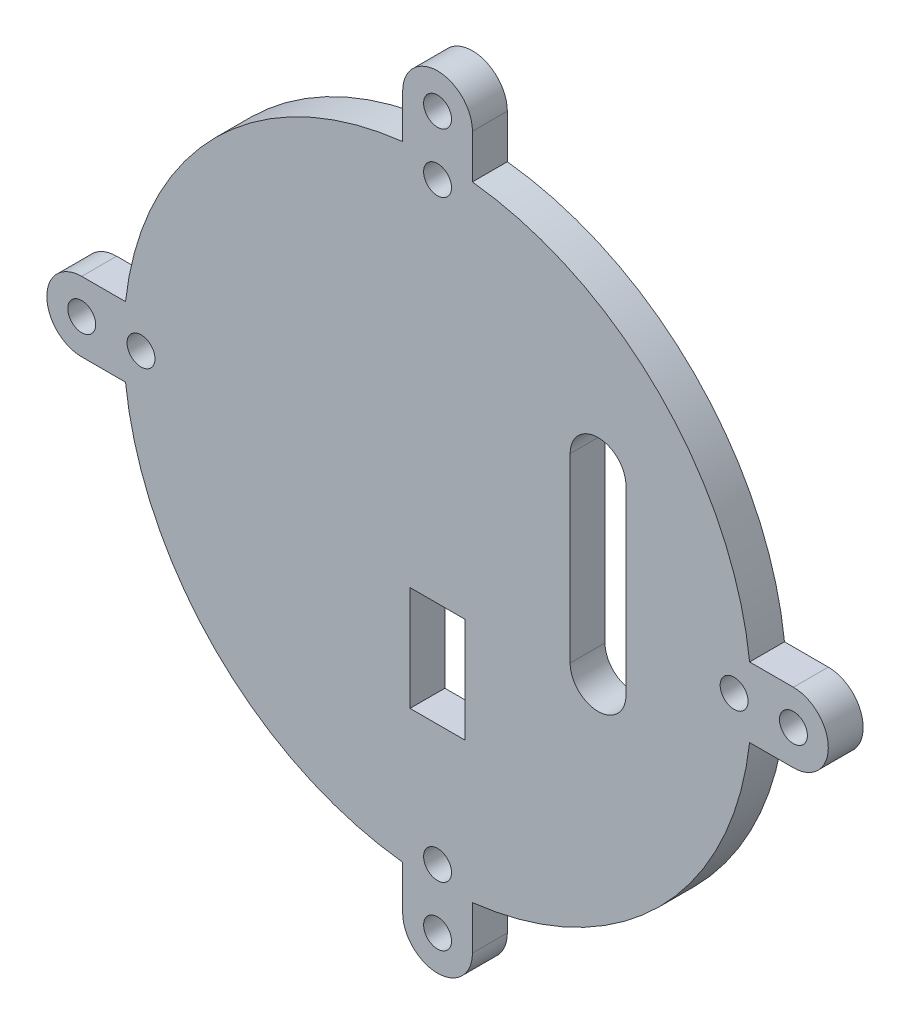
ISO-10303-21;
HEADER;
FILE_DESCRIPTION(('STEP AP214'),'2;1');
FILE_NAME('part.step','',(''),(''),'','','');
FILE_SCHEMA(('AUTOMOTIVE_DESIGN { 1 0 10303 214 1 1 1 1 }'));
ENDSEC;
DATA;
#1=APPLICATION_CONTEXT('core data for automotive mechanical design processes');
#2=APPLICATION_PROTOCOL_DEFINITION('international standard','automotive_design',2000,#1);
#3=PRODUCT_CONTEXT('',#1,'mechanical');
#4=PRODUCT('Part','Part','',(#3));
#5=PRODUCT_RELATED_PRODUCT_CATEGORY('part','',(#4));
#6=PRODUCT_DEFINITION_FORMATION('','',#4);
#7=PRODUCT_DEFINITION_CONTEXT('part definition',#1,'design');
#8=PRODUCT_DEFINITION('design','',#6,#7);
#9=PRODUCT_DEFINITION_SHAPE('','',#8);
#10=(LENGTH_UNIT() NAMED_UNIT(*) SI_UNIT(.MILLI.,.METRE.));
#11=(NAMED_UNIT(*) PLANE_ANGLE_UNIT() SI_UNIT($,.RADIAN.));
#12=(NAMED_UNIT(*) SI_UNIT($,.STERADIAN.) SOLID_ANGLE_UNIT());
#13=UNCERTAINTY_MEASURE_WITH_UNIT(LENGTH_MEASURE(1.E-05),#10,'distance_accuracy_value','');
#14=(GEOMETRIC_REPRESENTATION_CONTEXT(3) GLOBAL_UNCERTAINTY_ASSIGNED_CONTEXT((#13)) GLOBAL_UNIT_ASSIGNED_CONTEXT((#10,
#11,#12)) REPRESENTATION_CONTEXT('',''));
#15=CARTESIAN_POINT('',(0.,0.,0.));
#16=DIRECTION('',(0.,0.,1.));
#17=DIRECTION('',(1.,0.,0.));
#18=AXIS2_PLACEMENT_3D('',#15,#16,#17);
#19=CARTESIAN_POINT('',(0.,5.00000000000128,5.));
#20=DIRECTION('',(0.,-1.,0.));
#21=DIRECTION('',(0.,0.,-1.));
#22=AXIS2_PLACEMENT_3D('',#19,#20,#21);
#23=PLANE('',#22);
#24=DIRECTION('',(-1.,0.,0.));
#25=VECTOR('',#24,1.);
#26=CARTESIAN_POINT('',(0.,5.00000000000128,0.));
#27=LINE('',#26,#25);
#28=CARTESIAN_POINT('',(50.9999999999998,5.00000000000128,0.));
#29=VERTEX_POINT('',#28);
#30=CARTESIAN_POINT('',(44.7213595499955,5.00000000000127,0.));
#31=VERTEX_POINT('',#30);
#32=EDGE_CURVE('E260',#29,#31,#27,.T.);
#33=ORIENTED_EDGE('',*,*,#32,.T.);
#34=DIRECTION('',(0.,0.,-1.));
#35=VECTOR('',#34,1.);
#36=CARTESIAN_POINT('',(44.7213595499955,5.00000000000127,5.));
#37=LINE('',#36,#35);
#38=CARTESIAN_POINT('',(44.7213595499955,5.00000000000127,5.));
#39=VERTEX_POINT('',#38);
#40=EDGE_CURVE('E11',#39,#31,#37,.T.);
#41=ORIENTED_EDGE('',*,*,#40,.F.);
#42=DIRECTION('',(-1.,0.,0.));
#43=VECTOR('',#42,1.);
#44=CARTESIAN_POINT('',(0.,5.00000000000128,5.));
#45=LINE('',#44,#43);
#46=CARTESIAN_POINT('',(50.9999999999998,5.00000000000128,5.));
#47=VERTEX_POINT('',#46);
#48=EDGE_CURVE('E261',#47,#39,#45,.T.);
#49=ORIENTED_EDGE('',*,*,#48,.F.);
#50=DIRECTION('',(0.,0.,-1.));
#51=VECTOR('',#50,1.);
#52=CARTESIAN_POINT('',(50.9999999999998,5.00000000000128,5.));
#53=LINE('',#52,#51);
#54=EDGE_CURVE('E320',#47,#29,#53,.T.);
#55=ORIENTED_EDGE('',*,*,#54,.T.);
#56=EDGE_LOOP('',(#33,#41,#49,#55));
#57=FACE_BOUND('',#56,.T.);
#58=ADVANCED_FACE('F36',(#57),#23,.F.);
#59=CARTESIAN_POINT('',(3.46944695195361E-13,0.,5.));
#60=DIRECTION('',(0.,0.,-1.));
#61=DIRECTION('',(-1.,0.,0.));
#62=AXIS2_PLACEMENT_3D('',#59,#60,#61);
#63=CYLINDRICAL_SURFACE('',#62,44.9999999999994);
#64=CARTESIAN_POINT('',(3.46944695195361E-13,0.,0.));
#65=DIRECTION('',(0.,0.,1.));
#66=DIRECTION('',(1.,0.,0.));
#67=AXIS2_PLACEMENT_3D('',#64,#65,#66);
#68=CIRCLE('',#67,44.9999999999994);
#69=CARTESIAN_POINT('',(5.00000000000035,44.7213595499955,0.));
#70=VERTEX_POINT('',#69);
#71=EDGE_CURVE('E323',#31,#70,#68,.T.);
#72=ORIENTED_EDGE('',*,*,#71,.T.);
#73=DIRECTION('',(0.,0.,-1.));
#74=VECTOR('',#73,1.);
#75=CARTESIAN_POINT('',(5.00000000000035,44.7213595499955,5.));
#76=LINE('',#75,#74);
#77=CARTESIAN_POINT('',(5.00000000000035,44.7213595499955,5.));
#78=VERTEX_POINT('',#77);
#79=EDGE_CURVE('E43',#78,#70,#76,.T.);
#80=ORIENTED_EDGE('',*,*,#79,.F.);
#81=CARTESIAN_POINT('',(3.46944695195361E-13,0.,5.));
#82=DIRECTION('',(0.,0.,1.));
#83=DIRECTION('',(1.,0.,0.));
#84=AXIS2_PLACEMENT_3D('',#81,#82,#83);
#85=CIRCLE('',#84,44.9999999999994);
#86=EDGE_CURVE('E264',#39,#78,#85,.T.);
#87=ORIENTED_EDGE('',*,*,#86,.F.);
#88=ORIENTED_EDGE('',*,*,#40,.T.);
#89=EDGE_LOOP('',(#72,#80,#87,#88));
#90=FACE_BOUND('',#89,.T.);
#91=ADVANCED_FACE('F417',(#90),#63,.T.);
#92=CARTESIAN_POINT('',(4.99999999999975,0.,5.));
#93=DIRECTION('',(1.,0.,0.));
#94=DIRECTION('',(0.,1.,0.));
#95=AXIS2_PLACEMENT_3D('',#92,#93,#94);
#96=PLANE('',#95);
#97=DIRECTION('',(0.,-1.,0.));
#98=VECTOR('',#97,1.);
#99=CARTESIAN_POINT('',(4.99999999999975,0.,0.));
#100=LINE('',#99,#98);
#101=CARTESIAN_POINT('',(5.00000000000046,50.9999999999999,0.));
#102=VERTEX_POINT('',#101);
#103=EDGE_CURVE('E326',#102,#70,#100,.T.);
#104=ORIENTED_EDGE('',*,*,#103,.F.);
#105=DIRECTION('',(0.,0.,-1.));
#106=VECTOR('',#105,1.);
#107=CARTESIAN_POINT('',(5.00000000000046,50.9999999999999,5.));
#108=LINE('',#107,#106);
#109=CARTESIAN_POINT('',(5.00000000000046,50.9999999999999,5.));
#110=VERTEX_POINT('',#109);
#111=EDGE_CURVE('E410',#110,#102,#108,.T.);
#112=ORIENTED_EDGE('',*,*,#111,.F.);
#113=DIRECTION('',(0.,-1.,0.));
#114=VECTOR('',#113,1.);
#115=CARTESIAN_POINT('',(4.99999999999975,0.,5.));
#116=LINE('',#115,#114);
#117=EDGE_CURVE('E267',#110,#78,#116,.T.);
#118=ORIENTED_EDGE('',*,*,#117,.T.);
#119=ORIENTED_EDGE('',*,*,#79,.T.);
#120=EDGE_LOOP('',(#104,#112,#118,#119));
#121=FACE_BOUND('',#120,.T.);
#122=ADVANCED_FACE('F414',(#121),#96,.T.);
#123=CARTESIAN_POINT('',(8.78637440582253E-13,51.,5.));
#124=DIRECTION('',(0.,0.,-1.));
#125=DIRECTION('',(-1.,0.,0.));
#126=AXIS2_PLACEMENT_3D('',#123,#124,#125);
#127=CYLINDRICAL_SURFACE('',#126,5.);
#128=CARTESIAN_POINT('',(8.78637440582253E-13,51.,0.));
#129=DIRECTION('',(0.,0.,1.));
#130=DIRECTION('',(1.,0.,0.));
#131=AXIS2_PLACEMENT_3D('',#128,#129,#130);
#132=CIRCLE('',#131,5.);
#133=CARTESIAN_POINT('',(-4.99999999999954,51.0000000000001,0.));
#134=VERTEX_POINT('',#133);
#135=EDGE_CURVE('E331',#102,#134,#132,.T.);
#136=ORIENTED_EDGE('',*,*,#135,.T.);
#137=DIRECTION('',(0.,0.,-1.));
#138=VECTOR('',#137,1.);
#139=CARTESIAN_POINT('',(-4.99999999999954,51.0000000000001,5.));
#140=LINE('',#139,#138);
#141=CARTESIAN_POINT('',(-4.99999999999954,51.0000000000001,5.));
#142=VERTEX_POINT('',#141);
#143=EDGE_CURVE('E407',#142,#134,#140,.T.);
#144=ORIENTED_EDGE('',*,*,#143,.F.);
#145=CARTESIAN_POINT('',(8.78637440582253E-13,51.,5.));
#146=DIRECTION('',(0.,0.,1.));
#147=DIRECTION('',(1.,0.,0.));
#148=AXIS2_PLACEMENT_3D('',#145,#146,#147);
#149=CIRCLE('',#148,5.);
#150=EDGE_CURVE('E272',#110,#142,#149,.T.);
#151=ORIENTED_EDGE('',*,*,#150,.F.);
#152=ORIENTED_EDGE('',*,*,#111,.T.);
#153=EDGE_LOOP('',(#136,#144,#151,#152));
#154=FACE_BOUND('',#153,.T.);
#155=ADVANCED_FACE('F427',(#154),#127,.T.);
#156=CARTESIAN_POINT('',(-5.00000000000024,0.,5.));
#157=DIRECTION('',(1.,0.,0.));
#158=DIRECTION('',(0.,1.,0.));
#159=AXIS2_PLACEMENT_3D('',#156,#157,#158);
#160=PLANE('',#159);
#161=DIRECTION('',(0.,-1.,0.));
#162=VECTOR('',#161,1.);
#163=CARTESIAN_POINT('',(-5.00000000000024,0.,0.));
#164=LINE('',#163,#162);
#165=CARTESIAN_POINT('',(-4.99999999999959,44.7213595499955,0.));
#166=VERTEX_POINT('',#165);
#167=EDGE_CURVE('E333',#134,#166,#164,.T.);
#168=ORIENTED_EDGE('',*,*,#167,.T.);
#169=DIRECTION('',(0.,0.,-1.));
#170=VECTOR('',#169,1.);
#171=CARTESIAN_POINT('',(-4.99999999999959,44.7213595499955,5.));
#172=LINE('',#171,#170);
#173=CARTESIAN_POINT('',(-4.99999999999959,44.7213595499955,5.));
#174=VERTEX_POINT('',#173);
#175=EDGE_CURVE('E404',#174,#166,#172,.T.);
#176=ORIENTED_EDGE('',*,*,#175,.F.);
#177=DIRECTION('',(0.,-1.,0.));
#178=VECTOR('',#177,1.);
#179=CARTESIAN_POINT('',(-5.00000000000024,0.,5.));
#180=LINE('',#179,#178);
#181=EDGE_CURVE('E274',#142,#174,#180,.T.);
#182=ORIENTED_EDGE('',*,*,#181,.F.);
#183=ORIENTED_EDGE('',*,*,#143,.T.);
#184=EDGE_LOOP('',(#168,#176,#182,#183));
#185=FACE_BOUND('',#184,.T.);
#186=ADVANCED_FACE('F431',(#185),#160,.F.);
#187=CARTESIAN_POINT('',(-44.7213595499953,5.00000000000104,0.));
#188=VERTEX_POINT('',#187);
#189=EDGE_CURVE('E328',#166,#188,#68,.T.);
#190=ORIENTED_EDGE('',*,*,#189,.T.);
#191=DIRECTION('',(0.,0.,-1.));
#192=VECTOR('',#191,1.);
#193=CARTESIAN_POINT('',(-44.7213595499953,5.00000000000104,5.));
#194=LINE('',#193,#192);
#195=CARTESIAN_POINT('',(-44.7213595499953,5.00000000000104,5.));
#196=VERTEX_POINT('',#195);
#197=EDGE_CURVE('E402',#196,#188,#194,.T.);
#198=ORIENTED_EDGE('',*,*,#197,.F.);
#199=EDGE_CURVE('E269',#174,#196,#85,.T.);
#200=ORIENTED_EDGE('',*,*,#199,.F.);
#201=ORIENTED_EDGE('',*,*,#175,.T.);
#202=EDGE_LOOP('',(#190,#198,#200,#201));
#203=FACE_BOUND('',#202,.T.);
#204=ADVANCED_FACE('F463',(#203),#63,.T.);
#205=CARTESIAN_POINT('',(1.22948901590497E-13,5.00000000000001,5.));
#206=DIRECTION('',(0.,1.,0.));
#207=DIRECTION('',(-1.,0.,0.));
#208=AXIS2_PLACEMENT_3D('',#205,#206,#207);
#209=PLANE('',#208);
#210=DIRECTION('',(1.,0.,0.));
#211=VECTOR('',#210,1.);
#212=CARTESIAN_POINT('',(1.22948901590497E-13,5.00000000000001,0.));
#213=LINE('',#212,#211);
#214=CARTESIAN_POINT('',(-51.0000000000001,5.00000000000126,0.));
#215=VERTEX_POINT('',#214);
#216=EDGE_CURVE('E335',#215,#188,#213,.T.);
#217=ORIENTED_EDGE('',*,*,#216,.F.);
#218=DIRECTION('',(0.,0.,-1.));
#219=VECTOR('',#218,1.);
#220=CARTESIAN_POINT('',(-51.0000000000001,5.00000000000126,5.));
#221=LINE('',#220,#219);
#222=CARTESIAN_POINT('',(-51.0000000000001,5.00000000000126,5.));
#223=VERTEX_POINT('',#222);
#224=EDGE_CURVE('E400',#223,#215,#221,.T.);
#225=ORIENTED_EDGE('',*,*,#224,.F.);
#226=DIRECTION('',(1.,0.,0.));
#227=VECTOR('',#226,1.);
#228=CARTESIAN_POINT('',(1.22948901590497E-13,5.00000000000001,5.));
#229=LINE('',#228,#227);
#230=EDGE_CURVE('E276',#223,#196,#229,.T.);
#231=ORIENTED_EDGE('',*,*,#230,.T.);
#232=ORIENTED_EDGE('',*,*,#197,.T.);
#233=EDGE_LOOP('',(#217,#225,#231,#232));
#234=FACE_BOUND('',#233,.T.);
#235=ADVANCED_FACE('F468',(#234),#209,.T.);
#236=CARTESIAN_POINT('',(-51.0000000000003,1.2637460522491E-12,5.));
#237=DIRECTION('',(0.,0.,-1.));
#238=DIRECTION('',(-1.,0.,0.));
#239=AXIS2_PLACEMENT_3D('',#236,#237,#238);
#240=CYLINDRICAL_SURFACE('',#239,5.00000000000105);
#241=CARTESIAN_POINT('',(-51.0000000000003,1.2637460522491E-12,0.));
#242=DIRECTION('',(0.,0.,1.));
#243=DIRECTION('',(1.,0.,0.));
#244=AXIS2_PLACEMENT_3D('',#241,#242,#243);
#245=CIRCLE('',#244,5.00000000000105);
#246=CARTESIAN_POINT('',(-50.9999999999837,-5.00000000000084,0.));
#247=VERTEX_POINT('',#246);
#248=EDGE_CURVE('E338',#215,#247,#245,.T.);
#249=ORIENTED_EDGE('',*,*,#248,.T.);
#250=DIRECTION('',(0.,0.,-1.));
#251=VECTOR('',#250,1.);
#252=CARTESIAN_POINT('',(-50.9999999999837,-5.00000000000084,5.));
#253=LINE('',#252,#251);
#254=CARTESIAN_POINT('',(-50.9999999999837,-5.00000000000084,5.));
#255=VERTEX_POINT('',#254);
#256=EDGE_CURVE('E397',#255,#247,#253,.T.);
#257=ORIENTED_EDGE('',*,*,#256,.F.);
#258=CARTESIAN_POINT('',(-51.0000000000003,1.2637460522491E-12,5.));
#259=DIRECTION('',(0.,0.,1.));
#260=DIRECTION('',(1.,0.,0.));
#261=AXIS2_PLACEMENT_3D('',#258,#259,#260);
#262=CIRCLE('',#261,5.00000000000105);
#263=EDGE_CURVE('E279',#223,#255,#262,.T.);
#264=ORIENTED_EDGE('',*,*,#263,.F.);
#265=ORIENTED_EDGE('',*,*,#224,.T.);
#266=EDGE_LOOP('',(#249,#257,#264,#265));
#267=FACE_BOUND('',#266,.T.);
#268=ADVANCED_FACE('F474',(#267),#240,.T.);
#269=CARTESIAN_POINT('',(-1.23639625757117E-13,-5.0000000000021,5.));
#270=DIRECTION('',(0.,1.,0.));
#271=DIRECTION('',(-1.,0.,0.));
#272=AXIS2_PLACEMENT_3D('',#269,#270,#271);
#273=PLANE('',#272);
#274=DIRECTION('',(1.,0.,0.));
#275=VECTOR('',#274,1.);
#276=CARTESIAN_POINT('',(-1.23639625757117E-13,-5.0000000000021,0.));
#277=LINE('',#276,#275);
#278=CARTESIAN_POINT('',(-44.7213595499955,-5.00000000000092,0.));
#279=VERTEX_POINT('',#278);
#280=EDGE_CURVE('E340',#247,#279,#277,.T.);
#281=ORIENTED_EDGE('',*,*,#280,.T.);
#282=DIRECTION('',(0.,0.,-1.));
#283=VECTOR('',#282,1.);
#284=CARTESIAN_POINT('',(-44.7213595499955,-5.00000000000092,5.));
#285=LINE('',#284,#283);
#286=CARTESIAN_POINT('',(-44.7213595499955,-5.00000000000092,5.));
#287=VERTEX_POINT('',#286);
#288=EDGE_CURVE('E394',#287,#279,#285,.T.);
#289=ORIENTED_EDGE('',*,*,#288,.F.);
#290=DIRECTION('',(1.,0.,0.));
#291=VECTOR('',#290,1.);
#292=CARTESIAN_POINT('',(-1.23639625757117E-13,-5.0000000000021,5.));
#293=LINE('',#292,#291);
#294=EDGE_CURVE('E281',#255,#287,#293,.T.);
#295=ORIENTED_EDGE('',*,*,#294,.F.);
#296=ORIENTED_EDGE('',*,*,#256,.T.);
#297=EDGE_LOOP('',(#281,#289,#295,#296));
#298=FACE_BOUND('',#297,.T.);
#299=ADVANCED_FACE('F476',(#298),#273,.F.);
#300=CARTESIAN_POINT('',(-4.9999999999991,-44.7213595499955,0.));
#301=VERTEX_POINT('',#300);
#302=EDGE_CURVE('E342',#279,#301,#68,.T.);
#303=ORIENTED_EDGE('',*,*,#302,.T.);
#304=DIRECTION('',(0.,0.,-1.));
#305=VECTOR('',#304,1.);
#306=CARTESIAN_POINT('',(-4.9999999999991,-44.7213595499955,5.));
#307=LINE('',#306,#305);
#308=CARTESIAN_POINT('',(-4.9999999999991,-44.7213595499955,5.));
#309=VERTEX_POINT('',#308);
#310=EDGE_CURVE('E392',#309,#301,#307,.T.);
#311=ORIENTED_EDGE('',*,*,#310,.F.);
#312=EDGE_CURVE('E283',#287,#309,#85,.T.);
#313=ORIENTED_EDGE('',*,*,#312,.F.);
#314=ORIENTED_EDGE('',*,*,#288,.T.);
#315=EDGE_LOOP('',(#303,#311,#313,#314));
#316=FACE_BOUND('',#315,.T.);
#317=ADVANCED_FACE('F478',(#316),#63,.T.);
#318=CARTESIAN_POINT('',(-4.99999999999912,0.,5.));
#319=DIRECTION('',(-1.,0.,0.));
#320=DIRECTION('',(0.,0.,1.));
#321=AXIS2_PLACEMENT_3D('',#318,#319,#320);
#322=PLANE('',#321);
#323=DIRECTION('',(0.,1.,0.));
#324=VECTOR('',#323,1.);
#325=CARTESIAN_POINT('',(-4.99999999999912,0.,0.));
#326=LINE('',#325,#324);
#327=CARTESIAN_POINT('',(-4.99999999999912,-50.9999999999999,0.));
#328=VERTEX_POINT('',#327);
#329=EDGE_CURVE('E343',#328,#301,#326,.T.);
#330=ORIENTED_EDGE('',*,*,#329,.F.);
#331=DIRECTION('',(0.,0.,-1.));
#332=VECTOR('',#331,1.);
#333=CARTESIAN_POINT('',(-4.99999999999912,-50.9999999999999,5.));
#334=LINE('',#333,#332);
#335=CARTESIAN_POINT('',(-4.99999999999912,-50.9999999999999,5.));
#336=VERTEX_POINT('',#335);
#337=EDGE_CURVE('E390',#336,#328,#334,.T.);
#338=ORIENTED_EDGE('',*,*,#337,.F.);
#339=DIRECTION('',(0.,1.,0.));
#340=VECTOR('',#339,1.);
#341=CARTESIAN_POINT('',(-4.99999999999912,0.,5.));
#342=LINE('',#341,#340);
#343=EDGE_CURVE('E284',#336,#309,#342,.T.);
#344=ORIENTED_EDGE('',*,*,#343,.T.);
#345=ORIENTED_EDGE('',*,*,#310,.T.);
#346=EDGE_LOOP('',(#330,#338,#344,#345));
#347=FACE_BOUND('',#346,.T.);
#348=ADVANCED_FACE('F489',(#347),#322,.T.);
#349=CARTESIAN_POINT('',(8.81239525796218E-13,-51.,5.));
#350=DIRECTION('',(0.,0.,-1.));
#351=DIRECTION('',(-1.,0.,0.));
#352=AXIS2_PLACEMENT_3D('',#349,#350,#351);
#353=CYLINDRICAL_SURFACE('',#352,5.);
#354=CARTESIAN_POINT('',(8.81239525796218E-13,-51.,0.));
#355=DIRECTION('',(0.,0.,1.));
#356=DIRECTION('',(1.,0.,0.));
#357=AXIS2_PLACEMENT_3D('',#354,#355,#356);
#358=CIRCLE('',#357,5.);
#359=CARTESIAN_POINT('',(5.00000000000088,-51.0000000000001,0.));
#360=VERTEX_POINT('',#359);
#361=EDGE_CURVE('E346',#328,#360,#358,.T.);
#362=ORIENTED_EDGE('',*,*,#361,.T.);
#363=DIRECTION('',(0.,0.,-1.));
#364=VECTOR('',#363,1.);
#365=CARTESIAN_POINT('',(5.00000000000088,-51.0000000000001,5.));
#366=LINE('',#365,#364);
#367=CARTESIAN_POINT('',(5.00000000000088,-51.0000000000001,5.));
#368=VERTEX_POINT('',#367);
#369=EDGE_CURVE('E387',#368,#360,#366,.T.);
#370=ORIENTED_EDGE('',*,*,#369,.F.);
#371=CARTESIAN_POINT('',(8.81239525796218E-13,-51.,5.));
#372=DIRECTION('',(0.,0.,1.));
#373=DIRECTION('',(1.,0.,0.));
#374=AXIS2_PLACEMENT_3D('',#371,#372,#373);
#375=CIRCLE('',#374,5.);
#376=EDGE_CURVE('E287',#336,#368,#375,.T.);
#377=ORIENTED_EDGE('',*,*,#376,.F.);
#378=ORIENTED_EDGE('',*,*,#337,.T.);
#379=EDGE_LOOP('',(#362,#370,#377,#378));
#380=FACE_BOUND('',#379,.T.);
#381=ADVANCED_FACE('F490',(#380),#353,.T.);
#382=CARTESIAN_POINT('',(5.00000000000088,0.,5.));
#383=DIRECTION('',(-1.,0.,0.));
#384=DIRECTION('',(0.,0.,1.));
#385=AXIS2_PLACEMENT_3D('',#382,#383,#384);
#386=PLANE('',#385);
#387=DIRECTION('',(0.,1.,0.));
#388=VECTOR('',#387,1.);
#389=CARTESIAN_POINT('',(5.00000000000088,0.,0.));
#390=LINE('',#389,#388);
#391=CARTESIAN_POINT('',(5.00000000000084,-44.7213595499955,0.));
#392=VERTEX_POINT('',#391);
#393=EDGE_CURVE('E348',#360,#392,#390,.T.);
#394=ORIENTED_EDGE('',*,*,#393,.T.);
#395=DIRECTION('',(0.,0.,-1.));
#396=VECTOR('',#395,1.);
#397=CARTESIAN_POINT('',(5.00000000000084,-44.7213595499955,5.));
#398=LINE('',#397,#396);
#399=CARTESIAN_POINT('',(5.00000000000084,-44.7213595499955,5.));
#400=VERTEX_POINT('',#399);
#401=EDGE_CURVE('E384',#400,#392,#398,.T.);
#402=ORIENTED_EDGE('',*,*,#401,.F.);
#403=DIRECTION('',(0.,1.,0.));
#404=VECTOR('',#403,1.);
#405=CARTESIAN_POINT('',(5.00000000000088,0.,5.));
#406=LINE('',#405,#404);
#407=EDGE_CURVE('E289',#368,#400,#406,.T.);
#408=ORIENTED_EDGE('',*,*,#407,.F.);
#409=ORIENTED_EDGE('',*,*,#369,.T.);
#410=EDGE_LOOP('',(#394,#402,#408,#409));
#411=FACE_BOUND('',#410,.T.);
#412=ADVANCED_FACE('F484',(#411),#386,.F.);
#413=CARTESIAN_POINT('',(44.7213595499956,-4.99999999999873,0.));
#414=VERTEX_POINT('',#413);
#415=EDGE_CURVE('E327',#392,#414,#68,.T.);
#416=ORIENTED_EDGE('',*,*,#415,.T.);
#417=DIRECTION('',(0.,0.,-1.));
#418=VECTOR('',#417,1.);
#419=CARTESIAN_POINT('',(44.7213595499956,-4.99999999999873,5.));
#420=LINE('',#419,#418);
#421=CARTESIAN_POINT('',(44.7213595499956,-4.99999999999873,5.));
#422=VERTEX_POINT('',#421);
#423=EDGE_CURVE('E382',#422,#414,#420,.T.);
#424=ORIENTED_EDGE('',*,*,#423,.F.);
#425=EDGE_CURVE('E268',#400,#422,#85,.T.);
#426=ORIENTED_EDGE('',*,*,#425,.F.);
#427=ORIENTED_EDGE('',*,*,#401,.T.);
#428=EDGE_LOOP('',(#416,#424,#426,#427));
#429=FACE_BOUND('',#428,.T.);
#430=ADVANCED_FACE('F454',(#429),#63,.T.);
#431=CARTESIAN_POINT('',(0.,-4.99999999999872,5.));
#432=DIRECTION('',(0.,-1.,0.));
#433=DIRECTION('',(0.,0.,-1.));
#434=AXIS2_PLACEMENT_3D('',#431,#432,#433);
#435=PLANE('',#434);
#436=DIRECTION('',(-1.,0.,0.));
#437=VECTOR('',#436,1.);
#438=CARTESIAN_POINT('',(0.,-4.99999999999872,0.));
#439=LINE('',#438,#437);
#440=CARTESIAN_POINT('',(50.9999999999997,-4.99999999999872,0.));
#441=VERTEX_POINT('',#440);
#442=EDGE_CURVE('E350',#441,#414,#439,.T.);
#443=ORIENTED_EDGE('',*,*,#442,.F.);
#444=DIRECTION('',(0.,0.,-1.));
#445=VECTOR('',#444,1.);
#446=CARTESIAN_POINT('',(50.9999999999997,-4.99999999999872,5.));
#447=LINE('',#446,#445);
#448=CARTESIAN_POINT('',(50.9999999999997,-4.99999999999872,5.));
#449=VERTEX_POINT('',#448);
#450=EDGE_CURVE('E380',#449,#441,#447,.T.);
#451=ORIENTED_EDGE('',*,*,#450,.F.);
#452=DIRECTION('',(-1.,0.,0.));
#453=VECTOR('',#452,1.);
#454=CARTESIAN_POINT('',(0.,-4.99999999999872,5.));
#455=LINE('',#454,#453);
#456=EDGE_CURVE('E291',#449,#422,#455,.T.);
#457=ORIENTED_EDGE('',*,*,#456,.T.);
#458=ORIENTED_EDGE('',*,*,#423,.T.);
#459=EDGE_LOOP('',(#443,#451,#457,#458));
#460=FACE_BOUND('',#459,.T.);
#461=ADVANCED_FACE('F449',(#460),#435,.T.);
#462=CARTESIAN_POINT('',(-51.0000000000003,1.2637460522491E-12,5.));
#463=DIRECTION('',(0.,0.,-1.));
#464=DIRECTION('',(-1.,0.,0.));
#465=AXIS2_PLACEMENT_3D('',#462,#463,#464);
#466=CYLINDRICAL_SURFACE('',#465,2.);
#467=CARTESIAN_POINT('',(-51.0000000000003,1.2637460522491E-12,5.));
#468=DIRECTION('',(0.,0.,1.));
#469=DIRECTION('',(1.,0.,0.));
#470=AXIS2_PLACEMENT_3D('',#467,#468,#469);
#471=CIRCLE('',#470,2.);
#472=CARTESIAN_POINT('',(-49.0000000000003,1.2637460522491E-12,5.));
#473=VERTEX_POINT('',#472);
#474=EDGE_CURVE('E314',#473,#473,#471,.T.);
#475=ORIENTED_EDGE('',*,*,#474,.T.);
#476=EDGE_LOOP('',(#475));
#477=FACE_BOUND('',#476,.T.);
#478=CARTESIAN_POINT('',(-51.0000000000003,1.2637460522491E-12,0.));
#479=DIRECTION('',(0.,0.,1.));
#480=DIRECTION('',(1.,0.,0.));
#481=AXIS2_PLACEMENT_3D('',#478,#479,#480);
#482=CIRCLE('',#481,2.);
#483=CARTESIAN_POINT('',(-49.0000000000003,1.2637460522491E-12,0.));
#484=VERTEX_POINT('',#483);
#485=EDGE_CURVE('E373',#484,#484,#482,.T.);
#486=ORIENTED_EDGE('',*,*,#485,.F.);
#487=EDGE_LOOP('',(#486));
#488=FACE_BOUND('',#487,.T.);
#489=ADVANCED_FACE('F513',(#477,#488),#466,.F.);
#490=CARTESIAN_POINT('',(8.81239525796218E-13,-51.,5.));
#491=DIRECTION('',(0.,0.,-1.));
#492=DIRECTION('',(-1.,0.,0.));
#493=AXIS2_PLACEMENT_3D('',#490,#491,#492);
#494=CYLINDRICAL_SURFACE('',#493,2.);
#495=CARTESIAN_POINT('',(8.81239525796218E-13,-51.,5.));
#496=DIRECTION('',(0.,0.,1.));
#497=DIRECTION('',(1.,0.,0.));
#498=AXIS2_PLACEMENT_3D('',#495,#496,#497);
#499=CIRCLE('',#498,2.);
#500=CARTESIAN_POINT('',(2.00000000000088,-51.,5.));
#501=VERTEX_POINT('',#500);
#502=EDGE_CURVE('E311',#501,#501,#499,.T.);
#503=ORIENTED_EDGE('',*,*,#502,.T.);
#504=EDGE_LOOP('',(#503));
#505=FACE_BOUND('',#504,.T.);
#506=CARTESIAN_POINT('',(8.81239525796218E-13,-51.,0.));
#507=DIRECTION('',(0.,0.,1.));
#508=DIRECTION('',(1.,0.,0.));
#509=AXIS2_PLACEMENT_3D('',#506,#507,#508);
#510=CIRCLE('',#509,2.);
#511=CARTESIAN_POINT('',(2.00000000000088,-51.,0.));
#512=VERTEX_POINT('',#511);
#513=EDGE_CURVE('E370',#512,#512,#510,.T.);
#514=ORIENTED_EDGE('',*,*,#513,.F.);
#515=EDGE_LOOP('',(#514));
#516=FACE_BOUND('',#515,.T.);
#517=ADVANCED_FACE('F592',(#505,#516),#494,.F.);
#518=CARTESIAN_POINT('',(50.9999999999997,1.28248314827606E-12,5.));
#519=DIRECTION('',(0.,0.,-1.));
#520=DIRECTION('',(-1.,0.,0.));
#521=AXIS2_PLACEMENT_3D('',#518,#519,#520);
#522=CYLINDRICAL_SURFACE('',#521,2.);
#523=CARTESIAN_POINT('',(50.9999999999997,1.28248314827606E-12,5.));
#524=DIRECTION('',(0.,0.,1.));
#525=DIRECTION('',(1.,0.,0.));
#526=AXIS2_PLACEMENT_3D('',#523,#524,#525);
#527=CIRCLE('',#526,2.);
#528=CARTESIAN_POINT('',(52.9999999999998,1.28248314827606E-12,5.));
#529=VERTEX_POINT('',#528);
#530=EDGE_CURVE('E308',#529,#529,#527,.T.);
#531=ORIENTED_EDGE('',*,*,#530,.T.);
#532=EDGE_LOOP('',(#531));
#533=FACE_BOUND('',#532,.T.);
#534=CARTESIAN_POINT('',(50.9999999999997,1.28248314827606E-12,0.));
#535=DIRECTION('',(0.,0.,1.));
#536=DIRECTION('',(1.,0.,0.));
#537=AXIS2_PLACEMENT_3D('',#534,#535,#536);
#538=CIRCLE('',#537,2.);
#539=CARTESIAN_POINT('',(52.9999999999998,1.28248314827606E-12,0.));
#540=VERTEX_POINT('',#539);
#541=EDGE_CURVE('E367',#540,#540,#538,.T.);
#542=ORIENTED_EDGE('',*,*,#541,.F.);
#543=EDGE_LOOP('',(#542));
#544=FACE_BOUND('',#543,.T.);
#545=ADVANCED_FACE('F602',(#533,#544),#522,.F.);
#546=CARTESIAN_POINT('',(42.5000000000009,0.,5.));
#547=DIRECTION('',(0.,0.,-1.));
#548=DIRECTION('',(-1.,0.,0.));
#549=AXIS2_PLACEMENT_3D('',#546,#547,#548);
#550=CYLINDRICAL_SURFACE('',#549,2.);
#551=CARTESIAN_POINT('',(42.5000000000009,0.,5.));
#552=DIRECTION('',(0.,0.,1.));
#553=DIRECTION('',(1.,0.,0.));
#554=AXIS2_PLACEMENT_3D('',#551,#552,#553);
#555=CIRCLE('',#554,2.);
#556=CARTESIAN_POINT('',(44.5000000000009,0.,5.));
#557=VERTEX_POINT('',#556);
#558=EDGE_CURVE('E305',#557,#557,#555,.T.);
#559=ORIENTED_EDGE('',*,*,#558,.T.);
#560=EDGE_LOOP('',(#559));
#561=FACE_BOUND('',#560,.T.);
#562=CARTESIAN_POINT('',(42.5000000000009,0.,0.));
#563=DIRECTION('',(0.,0.,1.));
#564=DIRECTION('',(1.,0.,0.));
#565=AXIS2_PLACEMENT_3D('',#562,#563,#564);
#566=CIRCLE('',#565,2.);
#567=CARTESIAN_POINT('',(44.5000000000009,0.,0.));
#568=VERTEX_POINT('',#567);
#569=EDGE_CURVE('E364',#568,#568,#566,.T.);
#570=ORIENTED_EDGE('',*,*,#569,.F.);
#571=EDGE_LOOP('',(#570));
#572=FACE_BOUND('',#571,.T.);
#573=ADVANCED_FACE('F612',(#561,#572),#550,.F.);
#574=CARTESIAN_POINT('',(8.92689973368246E-13,-42.5,5.));
#575=DIRECTION('',(0.,0.,-1.));
#576=DIRECTION('',(-1.,0.,0.));
#577=AXIS2_PLACEMENT_3D('',#574,#575,#576);
#578=CYLINDRICAL_SURFACE('',#577,2.);
#579=CARTESIAN_POINT('',(8.92689973368246E-13,-42.5,5.));
#580=DIRECTION('',(0.,0.,1.));
#581=DIRECTION('',(1.,0.,0.));
#582=AXIS2_PLACEMENT_3D('',#579,#580,#581);
#583=CIRCLE('',#582,2.);
#584=CARTESIAN_POINT('',(2.00000000000089,-42.5,5.));
#585=VERTEX_POINT('',#584);
#586=EDGE_CURVE('E302',#585,#585,#583,.T.);
#587=ORIENTED_EDGE('',*,*,#586,.T.);
#588=EDGE_LOOP('',(#587));
#589=FACE_BOUND('',#588,.T.);
#590=CARTESIAN_POINT('',(8.92689973368246E-13,-42.5,0.));
#591=DIRECTION('',(0.,0.,1.));
#592=DIRECTION('',(1.,0.,0.));
#593=AXIS2_PLACEMENT_3D('',#590,#591,#592);
#594=CIRCLE('',#593,2.);
#595=CARTESIAN_POINT('',(2.00000000000089,-42.5,0.));
#596=VERTEX_POINT('',#595);
#597=EDGE_CURVE('E361',#596,#596,#594,.T.);
#598=ORIENTED_EDGE('',*,*,#597,.F.);
#599=EDGE_LOOP('',(#598));
#600=FACE_BOUND('',#599,.T.);
#601=ADVANCED_FACE('F622',(#589,#600),#578,.F.);
#602=CARTESIAN_POINT('',(-42.4999999999991,9.03591031208339E-13,5.));
#603=DIRECTION('',(0.,0.,-1.));
#604=DIRECTION('',(-1.,0.,0.));
#605=AXIS2_PLACEMENT_3D('',#602,#603,#604);
#606=CYLINDRICAL_SURFACE('',#605,2.);
#607=CARTESIAN_POINT('',(-42.4999999999991,9.03591031208339E-13,5.));
#608=DIRECTION('',(0.,0.,1.));
#609=DIRECTION('',(1.,0.,0.));
#610=AXIS2_PLACEMENT_3D('',#607,#608,#609);
#611=CIRCLE('',#610,2.);
#612=CARTESIAN_POINT('',(-40.4999999999991,9.03591031208339E-13,5.));
#613=VERTEX_POINT('',#612);
#614=EDGE_CURVE('E299',#613,#613,#611,.T.);
#615=ORIENTED_EDGE('',*,*,#614,.T.);
#616=EDGE_LOOP('',(#615));
#617=FACE_BOUND('',#616,.T.);
#618=CARTESIAN_POINT('',(-42.4999999999991,9.03591031208339E-13,0.));
#619=DIRECTION('',(0.,0.,1.));
#620=DIRECTION('',(1.,0.,0.));
#621=AXIS2_PLACEMENT_3D('',#618,#619,#620);
#622=CIRCLE('',#621,2.);
#623=CARTESIAN_POINT('',(-40.4999999999991,9.03591031208339E-13,0.));
#624=VERTEX_POINT('',#623);
#625=EDGE_CURVE('E358',#624,#624,#622,.T.);
#626=ORIENTED_EDGE('',*,*,#625,.F.);
#627=EDGE_LOOP('',(#626));
#628=FACE_BOUND('',#627,.T.);
#629=ADVANCED_FACE('F632',(#617,#628),#606,.F.);
#630=CARTESIAN_POINT('',(7.13123093545482E-13,42.5,5.));
#631=DIRECTION('',(0.,0.,-1.));
#632=DIRECTION('',(-1.,0.,0.));
#633=AXIS2_PLACEMENT_3D('',#630,#631,#632);
#634=CYLINDRICAL_SURFACE('',#633,2.);
#635=CARTESIAN_POINT('',(7.13123093545482E-13,42.5,5.));
#636=DIRECTION('',(0.,0.,1.));
#637=DIRECTION('',(1.,0.,0.));
#638=AXIS2_PLACEMENT_3D('',#635,#636,#637);
#639=CIRCLE('',#638,2.);
#640=CARTESIAN_POINT('',(2.00000000000071,42.5,5.));
#641=VERTEX_POINT('',#640);
#642=EDGE_CURVE('E296',#641,#641,#639,.T.);
#643=ORIENTED_EDGE('',*,*,#642,.T.);
#644=EDGE_LOOP('',(#643));
#645=FACE_BOUND('',#644,.T.);
#646=CARTESIAN_POINT('',(7.13123093545482E-13,42.5,0.));
#647=DIRECTION('',(0.,0.,1.));
#648=DIRECTION('',(1.,0.,0.));
#649=AXIS2_PLACEMENT_3D('',#646,#647,#648);
#650=CIRCLE('',#649,2.);
#651=CARTESIAN_POINT('',(2.00000000000071,42.5,0.));
#652=VERTEX_POINT('',#651);
#653=EDGE_CURVE('E355',#652,#652,#650,.T.);
#654=ORIENTED_EDGE('',*,*,#653,.F.);
#655=EDGE_LOOP('',(#654));
#656=FACE_BOUND('',#655,.T.);
#657=ADVANCED_FACE('F642',(#645,#656),#634,.F.);
#658=CARTESIAN_POINT('',(50.9999999999997,1.28248314827606E-12,5.));
#659=DIRECTION('',(0.,0.,-1.));
#660=DIRECTION('',(-1.,0.,0.));
#661=AXIS2_PLACEMENT_3D('',#658,#659,#660);
#662=CYLINDRICAL_SURFACE('',#661,5.);
#663=CARTESIAN_POINT('',(50.9999999999997,1.28248314827606E-12,0.));
#664=DIRECTION('',(0.,0.,1.));
#665=DIRECTION('',(1.,0.,0.));
#666=AXIS2_PLACEMENT_3D('',#663,#664,#665);
#667=CIRCLE('',#666,5.);
#668=EDGE_CURVE('E353',#441,#29,#667,.T.);
#669=ORIENTED_EDGE('',*,*,#668,.T.);
#670=ORIENTED_EDGE('',*,*,#54,.F.);
#671=CARTESIAN_POINT('',(50.9999999999997,1.28248314827606E-12,5.));
#672=DIRECTION('',(0.,0.,1.));
#673=DIRECTION('',(1.,0.,0.));
#674=AXIS2_PLACEMENT_3D('',#671,#672,#673);
#675=CIRCLE('',#674,5.);
#676=EDGE_CURVE('E294',#449,#47,#675,.T.);
#677=ORIENTED_EDGE('',*,*,#676,.F.);
#678=ORIENTED_EDGE('',*,*,#450,.T.);
#679=EDGE_LOOP('',(#669,#670,#677,#678));
#680=FACE_BOUND('',#679,.T.);
#681=ADVANCED_FACE('F652',(#680),#662,.T.);
#682=CARTESIAN_POINT('',(8.78637440582253E-13,51.,5.));
#683=DIRECTION('',(0.,0.,-1.));
#684=DIRECTION('',(-1.,0.,0.));
#685=AXIS2_PLACEMENT_3D('',#682,#683,#684);
#686=CYLINDRICAL_SURFACE('',#685,2.);
#687=CARTESIAN_POINT('',(8.78637440582253E-13,51.,5.));
#688=DIRECTION('',(0.,0.,1.));
#689=DIRECTION('',(1.,0.,0.));
#690=AXIS2_PLACEMENT_3D('',#687,#688,#689);
#691=CIRCLE('',#690,2.);
#692=CARTESIAN_POINT('',(2.00000000000088,51.,5.));
#693=VERTEX_POINT('',#692);
#694=EDGE_CURVE('E317',#693,#693,#691,.T.);
#695=ORIENTED_EDGE('',*,*,#694,.T.);
#696=EDGE_LOOP('',(#695));
#697=FACE_BOUND('',#696,.T.);
#698=CARTESIAN_POINT('',(8.78637440582253E-13,51.,0.));
#699=DIRECTION('',(0.,0.,1.));
#700=DIRECTION('',(1.,0.,0.));
#701=AXIS2_PLACEMENT_3D('',#698,#699,#700);
#702=CIRCLE('',#701,2.);
#703=CARTESIAN_POINT('',(2.00000000000088,51.,0.));
#704=VERTEX_POINT('',#703);
#705=EDGE_CURVE('E265',#704,#704,#702,.T.);
#706=ORIENTED_EDGE('',*,*,#705,.F.);
#707=EDGE_LOOP('',(#706));
#708=FACE_BOUND('',#707,.T.);
#709=ADVANCED_FACE('F662',(#697,#708),#686,.F.);
#710=CARTESIAN_POINT('',(0.,0.,5.));
#711=DIRECTION('',(0.,0.,1.));
#712=DIRECTION('',(1.,0.,0.));
#713=AXIS2_PLACEMENT_3D('',#710,#711,#712);
#714=PLANE('',#713);
#715=CARTESIAN_POINT('',(23.,18.,5.));
#716=DIRECTION('',(0.,0.,1.));
#717=DIRECTION('',(1.,0.,0.));
#718=AXIS2_PLACEMENT_3D('',#715,#716,#717);
#719=CIRCLE('',#718,4.00000000000001);
#720=CARTESIAN_POINT('',(27.,18.,5.));
#721=VERTEX_POINT('',#720);
#722=CARTESIAN_POINT('',(19.,18.,5.));
#723=VERTEX_POINT('',#722);
#724=EDGE_CURVE('E229',#721,#723,#719,.T.);
#725=ORIENTED_EDGE('',*,*,#724,.F.);
#726=DIRECTION('',(0.,1.,0.));
#727=VECTOR('',#726,1.);
#728=CARTESIAN_POINT('',(27.,0.,5.));
#729=LINE('',#728,#727);
#730=CARTESIAN_POINT('',(27.,-8.,5.));
#731=VERTEX_POINT('',#730);
#732=EDGE_CURVE('E222',#731,#721,#729,.T.);
#733=ORIENTED_EDGE('',*,*,#732,.F.);
#734=CARTESIAN_POINT('',(23.,-8.,5.));
#735=DIRECTION('',(0.,0.,1.));
#736=DIRECTION('',(1.,0.,0.));
#737=AXIS2_PLACEMENT_3D('',#734,#735,#736);
#738=CIRCLE('',#737,4.00000000000001);
#739=CARTESIAN_POINT('',(19.,-8.,5.));
#740=VERTEX_POINT('',#739);
#741=EDGE_CURVE('E202',#740,#731,#738,.T.);
#742=ORIENTED_EDGE('',*,*,#741,.F.);
#743=DIRECTION('',(0.,-1.,0.));
#744=VECTOR('',#743,1.);
#745=CARTESIAN_POINT('',(19.,0.,5.));
#746=LINE('',#745,#744);
#747=EDGE_CURVE('E227',#723,#740,#746,.T.);
#748=ORIENTED_EDGE('',*,*,#747,.F.);
#749=EDGE_LOOP('',(#725,#733,#742,#748));
#750=FACE_BOUND('',#749,.T.);
#751=DIRECTION('',(0.,1.,0.));
#752=VECTOR('',#751,1.);
#753=CARTESIAN_POINT('',(3.95,0.,5.));
#754=LINE('',#753,#752);
#755=CARTESIAN_POINT('',(3.95,-25.1,5.));
#756=VERTEX_POINT('',#755);
#757=CARTESIAN_POINT('',(3.95,-10.1,5.));
#758=VERTEX_POINT('',#757);
#759=EDGE_CURVE('E258',#756,#758,#754,.T.);
#760=ORIENTED_EDGE('',*,*,#759,.F.);
#761=DIRECTION('',(1.,0.,0.));
#762=VECTOR('',#761,1.);
#763=CARTESIAN_POINT('',(0.,-25.1,5.));
#764=LINE('',#763,#762);
#765=CARTESIAN_POINT('',(-3.95,-25.1,5.));
#766=VERTEX_POINT('',#765);
#767=EDGE_CURVE('E245',#766,#756,#764,.T.);
#768=ORIENTED_EDGE('',*,*,#767,.F.);
#769=DIRECTION('',(0.,-1.,0.));
#770=VECTOR('',#769,1.);
#771=CARTESIAN_POINT('',(-3.95,0.,5.));
#772=LINE('',#771,#770);
#773=CARTESIAN_POINT('',(-3.95,-10.1,5.));
#774=VERTEX_POINT('',#773);
#775=EDGE_CURVE('E253',#774,#766,#772,.T.);
#776=ORIENTED_EDGE('',*,*,#775,.F.);
#777=DIRECTION('',(-1.,0.,0.));
#778=VECTOR('',#777,1.);
#779=CARTESIAN_POINT('',(0.,-10.1,5.));
#780=LINE('',#779,#778);
#781=EDGE_CURVE('E256',#758,#774,#780,.T.);
#782=ORIENTED_EDGE('',*,*,#781,.F.);
#783=EDGE_LOOP('',(#760,#768,#776,#782));
#784=FACE_BOUND('',#783,.T.);
#785=ORIENTED_EDGE('',*,*,#48,.T.);
#786=ORIENTED_EDGE('',*,*,#86,.T.);
#787=ORIENTED_EDGE('',*,*,#117,.F.);
#788=ORIENTED_EDGE('',*,*,#150,.T.);
#789=ORIENTED_EDGE('',*,*,#181,.T.);
#790=ORIENTED_EDGE('',*,*,#199,.T.);
#791=ORIENTED_EDGE('',*,*,#230,.F.);
#792=ORIENTED_EDGE('',*,*,#263,.T.);
#793=ORIENTED_EDGE('',*,*,#294,.T.);
#794=ORIENTED_EDGE('',*,*,#312,.T.);
#795=ORIENTED_EDGE('',*,*,#343,.F.);
#796=ORIENTED_EDGE('',*,*,#376,.T.);
#797=ORIENTED_EDGE('',*,*,#407,.T.);
#798=ORIENTED_EDGE('',*,*,#425,.T.);
#799=ORIENTED_EDGE('',*,*,#456,.F.);
#800=ORIENTED_EDGE('',*,*,#676,.T.);
#801=EDGE_LOOP('',(#785,#786,#787,#788,#789,#790,#791,#792,#793,#794,#795,#796,#797,#798,#799,#800));
#802=FACE_BOUND('',#801,.T.);
#803=ORIENTED_EDGE('',*,*,#642,.F.);
#804=EDGE_LOOP('',(#803));
#805=FACE_BOUND('',#804,.T.);
#806=ORIENTED_EDGE('',*,*,#614,.F.);
#807=EDGE_LOOP('',(#806));
#808=FACE_BOUND('',#807,.T.);
#809=ORIENTED_EDGE('',*,*,#586,.F.);
#810=EDGE_LOOP('',(#809));
#811=FACE_BOUND('',#810,.T.);
#812=ORIENTED_EDGE('',*,*,#558,.F.);
#813=EDGE_LOOP('',(#812));
#814=FACE_BOUND('',#813,.T.);
#815=ORIENTED_EDGE('',*,*,#530,.F.);
#816=EDGE_LOOP('',(#815));
#817=FACE_BOUND('',#816,.T.);
#818=ORIENTED_EDGE('',*,*,#502,.F.);
#819=EDGE_LOOP('',(#818));
#820=FACE_BOUND('',#819,.T.);
#821=ORIENTED_EDGE('',*,*,#474,.F.);
#822=EDGE_LOOP('',(#821));
#823=FACE_BOUND('',#822,.T.);
#824=ORIENTED_EDGE('',*,*,#694,.F.);
#825=EDGE_LOOP('',(#824));
#826=FACE_BOUND('',#825,.T.);
#827=ADVANCED_FACE('F435',(#750,#784,#802,#805,#808,#811,#814,#817,#820,#823,#826),#714,.T.);
#828=CARTESIAN_POINT('',(0.,0.,0.));
#829=DIRECTION('',(0.,0.,1.));
#830=DIRECTION('',(1.,0.,0.));
#831=AXIS2_PLACEMENT_3D('',#828,#829,#830);
#832=PLANE('',#831);
#833=DIRECTION('',(0.,-1.,0.));
#834=VECTOR('',#833,1.);
#835=CARTESIAN_POINT('',(27.,18.,0.));
#836=LINE('',#835,#834);
#837=CARTESIAN_POINT('',(27.,18.,0.));
#838=VERTEX_POINT('',#837);
#839=CARTESIAN_POINT('',(27.,-8.,0.));
#840=VERTEX_POINT('',#839);
#841=EDGE_CURVE('E208',#838,#840,#836,.T.);
#842=ORIENTED_EDGE('',*,*,#841,.F.);
#843=CARTESIAN_POINT('',(23.,18.,0.));
#844=DIRECTION('',(0.,0.,-1.));
#845=DIRECTION('',(-1.,0.,0.));
#846=AXIS2_PLACEMENT_3D('',#843,#844,#845);
#847=CIRCLE('',#846,4.00000000000001);
#848=CARTESIAN_POINT('',(19.,18.,0.));
#849=VERTEX_POINT('',#848);
#850=EDGE_CURVE('E58',#849,#838,#847,.T.);
#851=ORIENTED_EDGE('',*,*,#850,.F.);
#852=DIRECTION('',(0.,1.,0.));
#853=VECTOR('',#852,1.);
#854=CARTESIAN_POINT('',(19.,18.,0.));
#855=LINE('',#854,#853);
#856=CARTESIAN_POINT('',(19.,-8.,0.));
#857=VERTEX_POINT('',#856);
#858=EDGE_CURVE('E215',#857,#849,#855,.T.);
#859=ORIENTED_EDGE('',*,*,#858,.F.);
#860=CARTESIAN_POINT('',(23.,-8.,0.));
#861=DIRECTION('',(0.,0.,-1.));
#862=DIRECTION('',(-1.,0.,0.));
#863=AXIS2_PLACEMENT_3D('',#860,#861,#862);
#864=CIRCLE('',#863,4.00000000000001);
#865=EDGE_CURVE('E199',#840,#857,#864,.T.);
#866=ORIENTED_EDGE('',*,*,#865,.F.);
#867=EDGE_LOOP('',(#842,#851,#859,#866));
#868=FACE_BOUND('',#867,.T.);
#869=DIRECTION('',(-1.,0.,0.));
#870=VECTOR('',#869,1.);
#871=CARTESIAN_POINT('',(3.95,-25.1,0.));
#872=LINE('',#871,#870);
#873=CARTESIAN_POINT('',(3.95,-25.1,0.));
#874=VERTEX_POINT('',#873);
#875=CARTESIAN_POINT('',(-3.95,-25.1,0.));
#876=VERTEX_POINT('',#875);
#877=EDGE_CURVE('E233',#874,#876,#872,.T.);
#878=ORIENTED_EDGE('',*,*,#877,.F.);
#879=DIRECTION('',(0.,-1.,0.));
#880=VECTOR('',#879,1.);
#881=CARTESIAN_POINT('',(3.95,-10.1,0.));
#882=LINE('',#881,#880);
#883=CARTESIAN_POINT('',(3.95,-10.1,0.));
#884=VERTEX_POINT('',#883);
#885=EDGE_CURVE('E231',#884,#874,#882,.T.);
#886=ORIENTED_EDGE('',*,*,#885,.F.);
#887=DIRECTION('',(1.,0.,0.));
#888=VECTOR('',#887,1.);
#889=CARTESIAN_POINT('',(3.95,-10.1,0.));
#890=LINE('',#889,#888);
#891=CARTESIAN_POINT('',(-3.95,-10.1,0.));
#892=VERTEX_POINT('',#891);
#893=EDGE_CURVE('E239',#892,#884,#890,.T.);
#894=ORIENTED_EDGE('',*,*,#893,.F.);
#895=DIRECTION('',(0.,1.,0.));
#896=VECTOR('',#895,1.);
#897=CARTESIAN_POINT('',(-3.95,-10.1,0.));
#898=LINE('',#897,#896);
#899=EDGE_CURVE('E236',#876,#892,#898,.T.);
#900=ORIENTED_EDGE('',*,*,#899,.F.);
#901=EDGE_LOOP('',(#878,#886,#894,#900));
#902=FACE_BOUND('',#901,.T.);
#903=ORIENTED_EDGE('',*,*,#32,.F.);
#904=ORIENTED_EDGE('',*,*,#668,.F.);
#905=ORIENTED_EDGE('',*,*,#442,.T.);
#906=ORIENTED_EDGE('',*,*,#415,.F.);
#907=ORIENTED_EDGE('',*,*,#393,.F.);
#908=ORIENTED_EDGE('',*,*,#361,.F.);
#909=ORIENTED_EDGE('',*,*,#329,.T.);
#910=ORIENTED_EDGE('',*,*,#302,.F.);
#911=ORIENTED_EDGE('',*,*,#280,.F.);
#912=ORIENTED_EDGE('',*,*,#248,.F.);
#913=ORIENTED_EDGE('',*,*,#216,.T.);
#914=ORIENTED_EDGE('',*,*,#189,.F.);
#915=ORIENTED_EDGE('',*,*,#167,.F.);
#916=ORIENTED_EDGE('',*,*,#135,.F.);
#917=ORIENTED_EDGE('',*,*,#103,.T.);
#918=ORIENTED_EDGE('',*,*,#71,.F.);
#919=EDGE_LOOP('',(#903,#904,#905,#906,#907,#908,#909,#910,#911,#912,#913,#914,#915,#916,#917,#918));
#920=FACE_BOUND('',#919,.T.);
#921=ORIENTED_EDGE('',*,*,#653,.T.);
#922=EDGE_LOOP('',(#921));
#923=FACE_BOUND('',#922,.T.);
#924=ORIENTED_EDGE('',*,*,#625,.T.);
#925=EDGE_LOOP('',(#924));
#926=FACE_BOUND('',#925,.T.);
#927=ORIENTED_EDGE('',*,*,#597,.T.);
#928=EDGE_LOOP('',(#927));
#929=FACE_BOUND('',#928,.T.);
#930=ORIENTED_EDGE('',*,*,#569,.T.);
#931=EDGE_LOOP('',(#930));
#932=FACE_BOUND('',#931,.T.);
#933=ORIENTED_EDGE('',*,*,#541,.T.);
#934=EDGE_LOOP('',(#933));
#935=FACE_BOUND('',#934,.T.);
#936=ORIENTED_EDGE('',*,*,#513,.T.);
#937=EDGE_LOOP('',(#936));
#938=FACE_BOUND('',#937,.T.);
#939=ORIENTED_EDGE('',*,*,#485,.T.);
#940=EDGE_LOOP('',(#939));
#941=FACE_BOUND('',#940,.T.);
#942=ORIENTED_EDGE('',*,*,#705,.T.);
#943=EDGE_LOOP('',(#942));
#944=FACE_BOUND('',#943,.T.);
#945=ADVANCED_FACE('F212',(#868,#902,#920,#923,#926,#929,#932,#935,#938,#941,#944),#832,.F.);
#946=CARTESIAN_POINT('',(3.95,-10.1,10.));
#947=DIRECTION('',(1.,0.,0.));
#948=DIRECTION('',(0.,1.,0.));
#949=AXIS2_PLACEMENT_3D('',#946,#947,#948);
#950=PLANE('',#949);
#951=ORIENTED_EDGE('',*,*,#759,.T.);
#952=DIRECTION('',(0.,0.,-1.));
#953=VECTOR('',#952,1.);
#954=CARTESIAN_POINT('',(3.95,-10.1,10.));
#955=LINE('',#954,#953);
#956=EDGE_CURVE('E243',#758,#884,#955,.T.);
#957=ORIENTED_EDGE('',*,*,#956,.T.);
#958=ORIENTED_EDGE('',*,*,#885,.T.);
#959=DIRECTION('',(0.,0.,-1.));
#960=VECTOR('',#959,1.);
#961=CARTESIAN_POINT('',(3.95,-25.1,10.));
#962=LINE('',#961,#960);
#963=EDGE_CURVE('E242',#756,#874,#962,.T.);
#964=ORIENTED_EDGE('',*,*,#963,.F.);
#965=EDGE_LOOP('',(#951,#957,#958,#964));
#966=FACE_BOUND('',#965,.T.);
#967=ADVANCED_FACE('F678',(#966),#950,.F.);
#968=CARTESIAN_POINT('',(3.95,-10.1,10.));
#969=DIRECTION('',(0.,1.,0.));
#970=DIRECTION('',(0.,0.,1.));
#971=AXIS2_PLACEMENT_3D('',#968,#969,#970);
#972=PLANE('',#971);
#973=ORIENTED_EDGE('',*,*,#781,.T.);
#974=DIRECTION('',(0.,0.,-1.));
#975=VECTOR('',#974,1.);
#976=CARTESIAN_POINT('',(-3.95,-10.1,10.));
#977=LINE('',#976,#975);
#978=EDGE_CURVE('E246',#774,#892,#977,.T.);
#979=ORIENTED_EDGE('',*,*,#978,.T.);
#980=ORIENTED_EDGE('',*,*,#893,.T.);
#981=ORIENTED_EDGE('',*,*,#956,.F.);
#982=EDGE_LOOP('',(#973,#979,#980,#981));
#983=FACE_BOUND('',#982,.T.);
#984=ADVANCED_FACE('F683',(#983),#972,.F.);
#985=CARTESIAN_POINT('',(-3.95,-10.1,10.));
#986=DIRECTION('',(-1.,0.,0.));
#987=DIRECTION('',(0.,-1.,0.));
#988=AXIS2_PLACEMENT_3D('',#985,#986,#987);
#989=PLANE('',#988);
#990=ORIENTED_EDGE('',*,*,#775,.T.);
#991=DIRECTION('',(0.,0.,-1.));
#992=VECTOR('',#991,1.);
#993=CARTESIAN_POINT('',(-3.95,-25.1,10.));
#994=LINE('',#993,#992);
#995=EDGE_CURVE('E248',#766,#876,#994,.T.);
#996=ORIENTED_EDGE('',*,*,#995,.T.);
#997=ORIENTED_EDGE('',*,*,#899,.T.);
#998=ORIENTED_EDGE('',*,*,#978,.F.);
#999=EDGE_LOOP('',(#990,#996,#997,#998));
#1000=FACE_BOUND('',#999,.T.);
#1001=ADVANCED_FACE('F695',(#1000),#989,.F.);
#1002=CARTESIAN_POINT('',(3.95,-25.1,10.));
#1003=DIRECTION('',(0.,-1.,0.));
#1004=DIRECTION('',(0.,0.,-1.));
#1005=AXIS2_PLACEMENT_3D('',#1002,#1003,#1004);
#1006=PLANE('',#1005);
#1007=ORIENTED_EDGE('',*,*,#767,.T.);
#1008=ORIENTED_EDGE('',*,*,#963,.T.);
#1009=ORIENTED_EDGE('',*,*,#877,.T.);
#1010=ORIENTED_EDGE('',*,*,#995,.F.);
#1011=EDGE_LOOP('',(#1007,#1008,#1009,#1010));
#1012=FACE_BOUND('',#1011,.T.);
#1013=ADVANCED_FACE('F705',(#1012),#1006,.F.);
#1014=CARTESIAN_POINT('',(23.,18.,10.));
#1015=DIRECTION('',(0.,0.,-1.));
#1016=DIRECTION('',(-1.,0.,0.));
#1017=AXIS2_PLACEMENT_3D('',#1014,#1015,#1016);
#1018=CYLINDRICAL_SURFACE('',#1017,4.00000000000001);
#1019=ORIENTED_EDGE('',*,*,#724,.T.);
#1020=DIRECTION('',(0.,0.,-1.));
#1021=VECTOR('',#1020,1.);
#1022=CARTESIAN_POINT('',(19.,18.,10.));
#1023=LINE('',#1022,#1021);
#1024=EDGE_CURVE('E220',#723,#849,#1023,.T.);
#1025=ORIENTED_EDGE('',*,*,#1024,.T.);
#1026=ORIENTED_EDGE('',*,*,#850,.T.);
#1027=DIRECTION('',(0.,0.,-1.));
#1028=VECTOR('',#1027,1.);
#1029=CARTESIAN_POINT('',(27.,18.,10.));
#1030=LINE('',#1029,#1028);
#1031=EDGE_CURVE('E205',#721,#838,#1030,.T.);
#1032=ORIENTED_EDGE('',*,*,#1031,.F.);
#1033=EDGE_LOOP('',(#1019,#1025,#1026,#1032));
#1034=FACE_BOUND('',#1033,.T.);
#1035=ADVANCED_FACE('F715',(#1034),#1018,.F.);
#1036=CARTESIAN_POINT('',(19.,18.,10.));
#1037=DIRECTION('',(-1.,0.,0.));
#1038=DIRECTION('',(0.,0.,1.));
#1039=AXIS2_PLACEMENT_3D('',#1036,#1037,#1038);
#1040=PLANE('',#1039);
#1041=ORIENTED_EDGE('',*,*,#747,.T.);
#1042=DIRECTION('',(0.,0.,-1.));
#1043=VECTOR('',#1042,1.);
#1044=CARTESIAN_POINT('',(19.,-8.,10.));
#1045=LINE('',#1044,#1043);
#1046=EDGE_CURVE('E204',#740,#857,#1045,.T.);
#1047=ORIENTED_EDGE('',*,*,#1046,.T.);
#1048=ORIENTED_EDGE('',*,*,#858,.T.);
#1049=ORIENTED_EDGE('',*,*,#1024,.F.);
#1050=EDGE_LOOP('',(#1041,#1047,#1048,#1049));
#1051=FACE_BOUND('',#1050,.T.);
#1052=ADVANCED_FACE('F742',(#1051),#1040,.F.);
#1053=CARTESIAN_POINT('',(23.,-8.,10.));
#1054=DIRECTION('',(0.,0.,-1.));
#1055=DIRECTION('',(-1.,0.,0.));
#1056=AXIS2_PLACEMENT_3D('',#1053,#1054,#1055);
#1057=CYLINDRICAL_SURFACE('',#1056,4.00000000000001);
#1058=ORIENTED_EDGE('',*,*,#741,.T.);
#1059=DIRECTION('',(0.,0.,-1.));
#1060=VECTOR('',#1059,1.);
#1061=CARTESIAN_POINT('',(27.,-8.,10.));
#1062=LINE('',#1061,#1060);
#1063=EDGE_CURVE('E50',#731,#840,#1062,.T.);
#1064=ORIENTED_EDGE('',*,*,#1063,.T.);
#1065=ORIENTED_EDGE('',*,*,#865,.T.);
#1066=ORIENTED_EDGE('',*,*,#1046,.F.);
#1067=EDGE_LOOP('',(#1058,#1064,#1065,#1066));
#1068=FACE_BOUND('',#1067,.T.);
#1069=ADVANCED_FACE('F196',(#1068),#1057,.F.);
#1070=CARTESIAN_POINT('',(27.,18.,10.));
#1071=DIRECTION('',(1.,0.,0.));
#1072=DIRECTION('',(0.,0.,-1.));
#1073=AXIS2_PLACEMENT_3D('',#1070,#1071,#1072);
#1074=PLANE('',#1073);
#1075=ORIENTED_EDGE('',*,*,#732,.T.);
#1076=ORIENTED_EDGE('',*,*,#1031,.T.);
#1077=ORIENTED_EDGE('',*,*,#841,.T.);
#1078=ORIENTED_EDGE('',*,*,#1063,.F.);
#1079=EDGE_LOOP('',(#1075,#1076,#1077,#1078));
#1080=FACE_BOUND('',#1079,.T.);
#1081=ADVANCED_FACE('F209',(#1080),#1074,.F.);
#1082=CLOSED_SHELL('',(#58,#91,#122,#155,#186,#204,#235,#268,#299,#317,#348,#381,#412,#430,#461,
#489,#517,#545,#573,#601,#629,#657,#681,#709,#827,#945,#967,#984,#1001,#1013,#1035,#1052,#1069,#1081));
#1083=MANIFOLD_SOLID_BREP('B2',#1082);
#1084=ADVANCED_BREP_SHAPE_REPRESENTATION('',(#18,#1083),#14);
#1085=SHAPE_DEFINITION_REPRESENTATION(#9,#1084);
ENDSEC;
END-ISO-10303-21;
